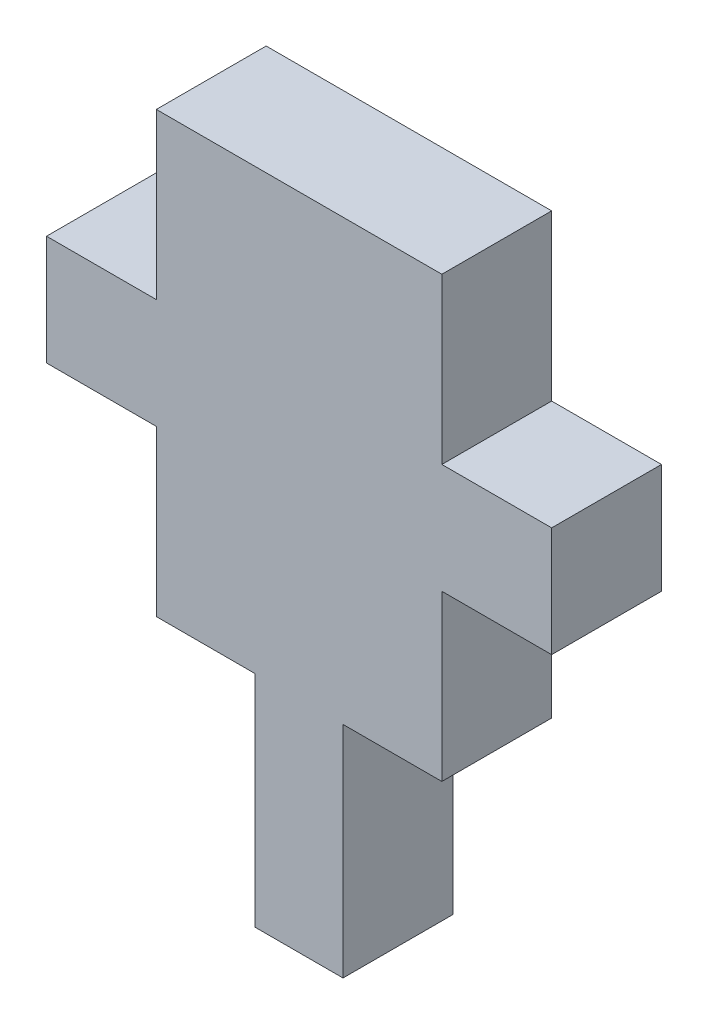
ISO-10303-21;
HEADER;
FILE_DESCRIPTION(('STEP AP214'),'2;1');
FILE_NAME('part.step','',(''),(''),'','','');
FILE_SCHEMA(('AUTOMOTIVE_DESIGN { 1 0 10303 214 1 1 1 1 }'));
ENDSEC;
DATA;
#1=APPLICATION_CONTEXT('core data for automotive mechanical design processes');
#2=APPLICATION_PROTOCOL_DEFINITION('international standard','automotive_design',2000,#1);
#3=PRODUCT_CONTEXT('',#1,'mechanical');
#4=PRODUCT('Part','Part','',(#3));
#5=PRODUCT_RELATED_PRODUCT_CATEGORY('part','',(#4));
#6=PRODUCT_DEFINITION_FORMATION('','',#4);
#7=PRODUCT_DEFINITION_CONTEXT('part definition',#1,'design');
#8=PRODUCT_DEFINITION('design','',#6,#7);
#9=PRODUCT_DEFINITION_SHAPE('','',#8);
#10=(LENGTH_UNIT() NAMED_UNIT(*) SI_UNIT(.MILLI.,.METRE.));
#11=(NAMED_UNIT(*) PLANE_ANGLE_UNIT() SI_UNIT($,.RADIAN.));
#12=(NAMED_UNIT(*) SI_UNIT($,.STERADIAN.) SOLID_ANGLE_UNIT());
#13=UNCERTAINTY_MEASURE_WITH_UNIT(LENGTH_MEASURE(1.E-05),#10,'distance_accuracy_value','');
#14=(GEOMETRIC_REPRESENTATION_CONTEXT(3) GLOBAL_UNCERTAINTY_ASSIGNED_CONTEXT((#13)) GLOBAL_UNIT_ASSIGNED_CONTEXT((#10,
#11,#12)) REPRESENTATION_CONTEXT('',''));
#15=CARTESIAN_POINT('',(0.,0.,0.));
#16=DIRECTION('',(0.,0.,1.));
#17=DIRECTION('',(1.,0.,0.));
#18=AXIS2_PLACEMENT_3D('',#15,#16,#17);
#19=CARTESIAN_POINT('',(8.5,0.,5.));
#20=DIRECTION('',(1.,0.,0.));
#21=DIRECTION('',(0.,0.,-1.));
#22=AXIS2_PLACEMENT_3D('',#19,#20,#21);
#23=PLANE('',#22);
#24=DIRECTION('',(0.,-1.,0.));
#25=VECTOR('',#24,1.);
#26=CARTESIAN_POINT('',(8.5,0.,0.));
#27=LINE('',#26,#25);
#28=CARTESIAN_POINT('',(8.5,0.,0.));
#29=VERTEX_POINT('',#28);
#30=CARTESIAN_POINT('',(8.5,-10.,0.));
#31=VERTEX_POINT('',#30);
#32=EDGE_CURVE('E179',#29,#31,#27,.T.);
#33=ORIENTED_EDGE('',*,*,#32,.F.);
#34=DIRECTION('',(0.,0.,-1.));
#35=VECTOR('',#34,1.);
#36=CARTESIAN_POINT('',(8.5,0.,5.));
#37=LINE('',#36,#35);
#38=CARTESIAN_POINT('',(8.5,0.,5.));
#39=VERTEX_POINT('',#38);
#40=EDGE_CURVE('E11',#39,#29,#37,.T.);
#41=ORIENTED_EDGE('',*,*,#40,.F.);
#42=DIRECTION('',(0.,-1.,0.));
#43=VECTOR('',#42,1.);
#44=CARTESIAN_POINT('',(8.5,0.,5.));
#45=LINE('',#44,#43);
#46=CARTESIAN_POINT('',(8.5,-10.,5.));
#47=VERTEX_POINT('',#46);
#48=EDGE_CURVE('E213',#39,#47,#45,.T.);
#49=ORIENTED_EDGE('',*,*,#48,.T.);
#50=DIRECTION('',(0.,0.,-1.));
#51=VECTOR('',#50,1.);
#52=CARTESIAN_POINT('',(8.5,-10.,5.));
#53=LINE('',#52,#51);
#54=EDGE_CURVE('E110',#47,#31,#53,.T.);
#55=ORIENTED_EDGE('',*,*,#54,.T.);
#56=EDGE_LOOP('',(#33,#41,#49,#55));
#57=FACE_BOUND('',#56,.T.);
#58=ADVANCED_FACE('F35',(#57),#23,.T.);
#59=CARTESIAN_POINT('',(0.,0.,5.));
#60=DIRECTION('',(0.,1.,0.));
#61=DIRECTION('',(0.,0.,1.));
#62=AXIS2_PLACEMENT_3D('',#59,#60,#61);
#63=PLANE('',#62);
#64=DIRECTION('',(1.,0.,0.));
#65=VECTOR('',#64,1.);
#66=CARTESIAN_POINT('',(0.,0.,0.));
#67=LINE('',#66,#65);
#68=CARTESIAN_POINT('',(13.,0.,0.));
#69=VERTEX_POINT('',#68);
#70=EDGE_CURVE('E182',#29,#69,#67,.T.);
#71=ORIENTED_EDGE('',*,*,#70,.T.);
#72=DIRECTION('',(0.,0.,-1.));
#73=VECTOR('',#72,1.);
#74=CARTESIAN_POINT('',(13.,0.,5.));
#75=LINE('',#74,#73);
#76=CARTESIAN_POINT('',(13.,0.,5.));
#77=VERTEX_POINT('',#76);
#78=EDGE_CURVE('E43',#77,#69,#75,.T.);
#79=ORIENTED_EDGE('',*,*,#78,.F.);
#80=DIRECTION('',(1.,0.,0.));
#81=VECTOR('',#80,1.);
#82=CARTESIAN_POINT('',(0.,0.,5.));
#83=LINE('',#82,#81);
#84=EDGE_CURVE('E164',#39,#77,#83,.T.);
#85=ORIENTED_EDGE('',*,*,#84,.F.);
#86=ORIENTED_EDGE('',*,*,#40,.T.);
#87=EDGE_LOOP('',(#71,#79,#85,#86));
#88=FACE_BOUND('',#87,.T.);
#89=ADVANCED_FACE('F328',(#88),#63,.F.);
#90=CARTESIAN_POINT('',(13.,0.,5.));
#91=DIRECTION('',(-1.,0.,0.));
#92=DIRECTION('',(0.,0.,1.));
#93=AXIS2_PLACEMENT_3D('',#90,#91,#92);
#94=PLANE('',#93);
#95=DIRECTION('',(0.,1.,0.));
#96=VECTOR('',#95,1.);
#97=CARTESIAN_POINT('',(13.,0.,0.));
#98=LINE('',#97,#96);
#99=CARTESIAN_POINT('',(13.,7.5,0.));
#100=VERTEX_POINT('',#99);
#101=EDGE_CURVE('E184',#69,#100,#98,.T.);
#102=ORIENTED_EDGE('',*,*,#101,.T.);
#103=DIRECTION('',(0.,0.,-1.));
#104=VECTOR('',#103,1.);
#105=CARTESIAN_POINT('',(13.,7.5,5.));
#106=LINE('',#105,#104);
#107=CARTESIAN_POINT('',(13.,7.5,5.));
#108=VERTEX_POINT('',#107);
#109=EDGE_CURVE('E237',#108,#100,#106,.T.);
#110=ORIENTED_EDGE('',*,*,#109,.F.);
#111=DIRECTION('',(0.,1.,0.));
#112=VECTOR('',#111,1.);
#113=CARTESIAN_POINT('',(13.,0.,5.));
#114=LINE('',#113,#112);
#115=EDGE_CURVE('E246',#77,#108,#114,.T.);
#116=ORIENTED_EDGE('',*,*,#115,.F.);
#117=ORIENTED_EDGE('',*,*,#78,.T.);
#118=EDGE_LOOP('',(#102,#110,#116,#117));
#119=FACE_BOUND('',#118,.T.);
#120=ADVANCED_FACE('F244',(#119),#94,.F.);
#121=CARTESIAN_POINT('',(0.,7.5,5.));
#122=DIRECTION('',(0.,1.,0.));
#123=DIRECTION('',(0.,0.,1.));
#124=AXIS2_PLACEMENT_3D('',#121,#122,#123);
#125=PLANE('',#124);
#126=DIRECTION('',(1.,0.,0.));
#127=VECTOR('',#126,1.);
#128=CARTESIAN_POINT('',(0.,7.5,0.));
#129=LINE('',#128,#127);
#130=CARTESIAN_POINT('',(18.,7.5,0.));
#131=VERTEX_POINT('',#130);
#132=EDGE_CURVE('E186',#100,#131,#129,.T.);
#133=ORIENTED_EDGE('',*,*,#132,.T.);
#134=DIRECTION('',(0.,0.,-1.));
#135=VECTOR('',#134,1.);
#136=CARTESIAN_POINT('',(18.,7.5,5.));
#137=LINE('',#136,#135);
#138=CARTESIAN_POINT('',(18.,7.5,5.));
#139=VERTEX_POINT('',#138);
#140=EDGE_CURVE('E234',#139,#131,#137,.T.);
#141=ORIENTED_EDGE('',*,*,#140,.F.);
#142=DIRECTION('',(1.,0.,0.));
#143=VECTOR('',#142,1.);
#144=CARTESIAN_POINT('',(0.,7.5,5.));
#145=LINE('',#144,#143);
#146=EDGE_CURVE('E265',#108,#139,#145,.T.);
#147=ORIENTED_EDGE('',*,*,#146,.F.);
#148=ORIENTED_EDGE('',*,*,#109,.T.);
#149=EDGE_LOOP('',(#133,#141,#147,#148));
#150=FACE_BOUND('',#149,.T.);
#151=ADVANCED_FACE('F255',(#150),#125,.F.);
#152=CARTESIAN_POINT('',(18.,0.,5.));
#153=DIRECTION('',(-1.,0.,0.));
#154=DIRECTION('',(0.,-1.,0.));
#155=AXIS2_PLACEMENT_3D('',#152,#153,#154);
#156=PLANE('',#155);
#157=DIRECTION('',(0.,1.,0.));
#158=VECTOR('',#157,1.);
#159=CARTESIAN_POINT('',(18.,0.,0.));
#160=LINE('',#159,#158);
#161=CARTESIAN_POINT('',(18.,12.5,0.));
#162=VERTEX_POINT('',#161);
#163=EDGE_CURVE('E189',#131,#162,#160,.T.);
#164=ORIENTED_EDGE('',*,*,#163,.T.);
#165=DIRECTION('',(0.,0.,-1.));
#166=VECTOR('',#165,1.);
#167=CARTESIAN_POINT('',(18.,12.5,5.));
#168=LINE('',#167,#166);
#169=CARTESIAN_POINT('',(18.,12.5,5.));
#170=VERTEX_POINT('',#169);
#171=EDGE_CURVE('E232',#170,#162,#168,.T.);
#172=ORIENTED_EDGE('',*,*,#171,.F.);
#173=DIRECTION('',(0.,1.,0.));
#174=VECTOR('',#173,1.);
#175=CARTESIAN_POINT('',(18.,0.,5.));
#176=LINE('',#175,#174);
#177=EDGE_CURVE('E261',#139,#170,#176,.T.);
#178=ORIENTED_EDGE('',*,*,#177,.F.);
#179=ORIENTED_EDGE('',*,*,#140,.T.);
#180=EDGE_LOOP('',(#164,#172,#178,#179));
#181=FACE_BOUND('',#180,.T.);
#182=ADVANCED_FACE('F259',(#181),#156,.F.);
#183=CARTESIAN_POINT('',(0.,12.5,5.));
#184=DIRECTION('',(0.,1.,0.));
#185=DIRECTION('',(0.,0.,1.));
#186=AXIS2_PLACEMENT_3D('',#183,#184,#185);
#187=PLANE('',#186);
#188=DIRECTION('',(1.,0.,0.));
#189=VECTOR('',#188,1.);
#190=CARTESIAN_POINT('',(0.,12.5,0.));
#191=LINE('',#190,#189);
#192=CARTESIAN_POINT('',(13.,12.5,0.));
#193=VERTEX_POINT('',#192);
#194=EDGE_CURVE('E192',#193,#162,#191,.T.);
#195=ORIENTED_EDGE('',*,*,#194,.F.);
#196=DIRECTION('',(0.,0.,-1.));
#197=VECTOR('',#196,1.);
#198=CARTESIAN_POINT('',(13.,12.5,5.));
#199=LINE('',#198,#197);
#200=CARTESIAN_POINT('',(13.,12.5,5.));
#201=VERTEX_POINT('',#200);
#202=EDGE_CURVE('E230',#201,#193,#199,.T.);
#203=ORIENTED_EDGE('',*,*,#202,.F.);
#204=DIRECTION('',(1.,0.,0.));
#205=VECTOR('',#204,1.);
#206=CARTESIAN_POINT('',(0.,12.5,5.));
#207=LINE('',#206,#205);
#208=EDGE_CURVE('E264',#201,#170,#207,.T.);
#209=ORIENTED_EDGE('',*,*,#208,.T.);
#210=ORIENTED_EDGE('',*,*,#171,.T.);
#211=EDGE_LOOP('',(#195,#203,#209,#210));
#212=FACE_BOUND('',#211,.T.);
#213=ADVANCED_FACE('F318',(#212),#187,.T.);
#214=CARTESIAN_POINT('',(13.,20.,0.));
#215=VERTEX_POINT('',#214);
#216=EDGE_CURVE('E187',#193,#215,#98,.T.);
#217=ORIENTED_EDGE('',*,*,#216,.T.);
#218=DIRECTION('',(0.,0.,-1.));
#219=VECTOR('',#218,1.);
#220=CARTESIAN_POINT('',(13.,20.,5.));
#221=LINE('',#220,#219);
#222=CARTESIAN_POINT('',(13.,20.,5.));
#223=VERTEX_POINT('',#222);
#224=EDGE_CURVE('E228',#223,#215,#221,.T.);
#225=ORIENTED_EDGE('',*,*,#224,.F.);
#226=EDGE_CURVE('E267',#201,#223,#114,.T.);
#227=ORIENTED_EDGE('',*,*,#226,.F.);
#228=ORIENTED_EDGE('',*,*,#202,.T.);
#229=EDGE_LOOP('',(#217,#225,#227,#228));
#230=FACE_BOUND('',#229,.T.);
#231=ADVANCED_FACE('F299',(#230),#94,.F.);
#232=CARTESIAN_POINT('',(0.,20.,5.));
#233=DIRECTION('',(0.,1.,0.));
#234=DIRECTION('',(0.,0.,1.));
#235=AXIS2_PLACEMENT_3D('',#232,#233,#234);
#236=PLANE('',#235);
#237=DIRECTION('',(1.,0.,0.));
#238=VECTOR('',#237,1.);
#239=CARTESIAN_POINT('',(0.,20.,0.));
#240=LINE('',#239,#238);
#241=CARTESIAN_POINT('',(0.,20.,0.));
#242=VERTEX_POINT('',#241);
#243=EDGE_CURVE('E195',#242,#215,#240,.T.);
#244=ORIENTED_EDGE('',*,*,#243,.F.);
#245=DIRECTION('',(0.,0.,-1.));
#246=VECTOR('',#245,1.);
#247=CARTESIAN_POINT('',(0.,20.,5.));
#248=LINE('',#247,#246);
#249=CARTESIAN_POINT('',(0.,20.,5.));
#250=VERTEX_POINT('',#249);
#251=EDGE_CURVE('E226',#250,#242,#248,.T.);
#252=ORIENTED_EDGE('',*,*,#251,.F.);
#253=DIRECTION('',(1.,0.,0.));
#254=VECTOR('',#253,1.);
#255=CARTESIAN_POINT('',(0.,20.,5.));
#256=LINE('',#255,#254);
#257=EDGE_CURVE('E272',#250,#223,#256,.T.);
#258=ORIENTED_EDGE('',*,*,#257,.T.);
#259=ORIENTED_EDGE('',*,*,#224,.T.);
#260=EDGE_LOOP('',(#244,#252,#258,#259));
#261=FACE_BOUND('',#260,.T.);
#262=ADVANCED_FACE('F303',(#261),#236,.T.);
#263=CARTESIAN_POINT('',(0.,0.,5.));
#264=DIRECTION('',(-1.,0.,0.));
#265=DIRECTION('',(0.,0.,1.));
#266=AXIS2_PLACEMENT_3D('',#263,#264,#265);
#267=PLANE('',#266);
#268=DIRECTION('',(0.,1.,0.));
#269=VECTOR('',#268,1.);
#270=CARTESIAN_POINT('',(0.,0.,0.));
#271=LINE('',#270,#269);
#272=CARTESIAN_POINT('',(0.,12.5,0.));
#273=VERTEX_POINT('',#272);
#274=EDGE_CURVE('E198',#273,#242,#271,.T.);
#275=ORIENTED_EDGE('',*,*,#274,.F.);
#276=DIRECTION('',(0.,0.,-1.));
#277=VECTOR('',#276,1.);
#278=CARTESIAN_POINT('',(0.,12.5,5.));
#279=LINE('',#278,#277);
#280=CARTESIAN_POINT('',(0.,12.5,5.));
#281=VERTEX_POINT('',#280);
#282=EDGE_CURVE('E224',#281,#273,#279,.T.);
#283=ORIENTED_EDGE('',*,*,#282,.F.);
#284=DIRECTION('',(0.,1.,0.));
#285=VECTOR('',#284,1.);
#286=CARTESIAN_POINT('',(0.,0.,5.));
#287=LINE('',#286,#285);
#288=EDGE_CURVE('E275',#281,#250,#287,.T.);
#289=ORIENTED_EDGE('',*,*,#288,.T.);
#290=ORIENTED_EDGE('',*,*,#251,.T.);
#291=EDGE_LOOP('',(#275,#283,#289,#290));
#292=FACE_BOUND('',#291,.T.);
#293=ADVANCED_FACE('F306',(#292),#267,.T.);
#294=CARTESIAN_POINT('',(0.,12.5,5.));
#295=DIRECTION('',(0.,-1.,0.));
#296=DIRECTION('',(0.,0.,-1.));
#297=AXIS2_PLACEMENT_3D('',#294,#295,#296);
#298=PLANE('',#297);
#299=DIRECTION('',(-1.,0.,0.));
#300=VECTOR('',#299,1.);
#301=CARTESIAN_POINT('',(0.,12.5,0.));
#302=LINE('',#301,#300);
#303=CARTESIAN_POINT('',(-5.,12.5,0.));
#304=VERTEX_POINT('',#303);
#305=EDGE_CURVE('E201',#273,#304,#302,.T.);
#306=ORIENTED_EDGE('',*,*,#305,.T.);
#307=DIRECTION('',(0.,0.,-1.));
#308=VECTOR('',#307,1.);
#309=CARTESIAN_POINT('',(-5.,12.5,5.));
#310=LINE('',#309,#308);
#311=CARTESIAN_POINT('',(-5.,12.5,5.));
#312=VERTEX_POINT('',#311);
#313=EDGE_CURVE('E221',#312,#304,#310,.T.);
#314=ORIENTED_EDGE('',*,*,#313,.F.);
#315=DIRECTION('',(-1.,0.,0.));
#316=VECTOR('',#315,1.);
#317=CARTESIAN_POINT('',(0.,12.5,5.));
#318=LINE('',#317,#316);
#319=EDGE_CURVE('E278',#281,#312,#318,.T.);
#320=ORIENTED_EDGE('',*,*,#319,.F.);
#321=ORIENTED_EDGE('',*,*,#282,.T.);
#322=EDGE_LOOP('',(#306,#314,#320,#321));
#323=FACE_BOUND('',#322,.T.);
#324=ADVANCED_FACE('F310',(#323),#298,.F.);
#325=CARTESIAN_POINT('',(-5.,0.,5.));
#326=DIRECTION('',(1.,0.,0.));
#327=DIRECTION('',(0.,1.,0.));
#328=AXIS2_PLACEMENT_3D('',#325,#326,#327);
#329=PLANE('',#328);
#330=DIRECTION('',(0.,-1.,0.));
#331=VECTOR('',#330,1.);
#332=CARTESIAN_POINT('',(-5.,0.,0.));
#333=LINE('',#332,#331);
#334=CARTESIAN_POINT('',(-5.,7.5,0.));
#335=VERTEX_POINT('',#334);
#336=EDGE_CURVE('E204',#304,#335,#333,.T.);
#337=ORIENTED_EDGE('',*,*,#336,.T.);
#338=DIRECTION('',(0.,0.,-1.));
#339=VECTOR('',#338,1.);
#340=CARTESIAN_POINT('',(-5.,7.5,5.));
#341=LINE('',#340,#339);
#342=CARTESIAN_POINT('',(-5.,7.5,5.));
#343=VERTEX_POINT('',#342);
#344=EDGE_CURVE('E219',#343,#335,#341,.T.);
#345=ORIENTED_EDGE('',*,*,#344,.F.);
#346=DIRECTION('',(0.,-1.,0.));
#347=VECTOR('',#346,1.);
#348=CARTESIAN_POINT('',(-5.,0.,5.));
#349=LINE('',#348,#347);
#350=EDGE_CURVE('E279',#312,#343,#349,.T.);
#351=ORIENTED_EDGE('',*,*,#350,.F.);
#352=ORIENTED_EDGE('',*,*,#313,.T.);
#353=EDGE_LOOP('',(#337,#345,#351,#352));
#354=FACE_BOUND('',#353,.T.);
#355=ADVANCED_FACE('F314',(#354),#329,.F.);
#356=CARTESIAN_POINT('',(0.,7.5,5.));
#357=DIRECTION('',(0.,-1.,0.));
#358=DIRECTION('',(1.,0.,0.));
#359=AXIS2_PLACEMENT_3D('',#356,#357,#358);
#360=PLANE('',#359);
#361=DIRECTION('',(-1.,0.,0.));
#362=VECTOR('',#361,1.);
#363=CARTESIAN_POINT('',(0.,7.5,0.));
#364=LINE('',#363,#362);
#365=CARTESIAN_POINT('',(0.,7.5,0.));
#366=VERTEX_POINT('',#365);
#367=EDGE_CURVE('E207',#366,#335,#364,.T.);
#368=ORIENTED_EDGE('',*,*,#367,.F.);
#369=DIRECTION('',(0.,0.,-1.));
#370=VECTOR('',#369,1.);
#371=CARTESIAN_POINT('',(0.,7.5,5.));
#372=LINE('',#371,#370);
#373=CARTESIAN_POINT('',(0.,7.5,5.));
#374=VERTEX_POINT('',#373);
#375=EDGE_CURVE('E217',#374,#366,#372,.T.);
#376=ORIENTED_EDGE('',*,*,#375,.F.);
#377=DIRECTION('',(-1.,0.,0.));
#378=VECTOR('',#377,1.);
#379=CARTESIAN_POINT('',(0.,7.5,5.));
#380=LINE('',#379,#378);
#381=EDGE_CURVE('E176',#374,#343,#380,.T.);
#382=ORIENTED_EDGE('',*,*,#381,.T.);
#383=ORIENTED_EDGE('',*,*,#344,.T.);
#384=EDGE_LOOP('',(#368,#376,#382,#383));
#385=FACE_BOUND('',#384,.T.);
#386=ADVANCED_FACE('F315',(#385),#360,.T.);
#387=CARTESIAN_POINT('',(0.,0.,0.));
#388=VERTEX_POINT('',#387);
#389=EDGE_CURVE('E202',#388,#366,#271,.T.);
#390=ORIENTED_EDGE('',*,*,#389,.F.);
#391=DIRECTION('',(0.,0.,-1.));
#392=VECTOR('',#391,1.);
#393=CARTESIAN_POINT('',(0.,0.,5.));
#394=LINE('',#393,#392);
#395=CARTESIAN_POINT('',(0.,0.,5.));
#396=VERTEX_POINT('',#395);
#397=EDGE_CURVE('E169',#396,#388,#394,.T.);
#398=ORIENTED_EDGE('',*,*,#397,.F.);
#399=EDGE_CURVE('E161',#396,#374,#287,.T.);
#400=ORIENTED_EDGE('',*,*,#399,.T.);
#401=ORIENTED_EDGE('',*,*,#375,.T.);
#402=EDGE_LOOP('',(#390,#398,#400,#401));
#403=FACE_BOUND('',#402,.T.);
#404=ADVANCED_FACE('F286',(#403),#267,.T.);
#405=CARTESIAN_POINT('',(4.5,0.,0.));
#406=VERTEX_POINT('',#405);
#407=EDGE_CURVE('E168',#388,#406,#67,.T.);
#408=ORIENTED_EDGE('',*,*,#407,.T.);
#409=DIRECTION('',(0.,0.,-1.));
#410=VECTOR('',#409,1.);
#411=CARTESIAN_POINT('',(4.5,0.,5.));
#412=LINE('',#411,#410);
#413=CARTESIAN_POINT('',(4.5,0.,5.));
#414=VERTEX_POINT('',#413);
#415=EDGE_CURVE('E165',#414,#406,#412,.T.);
#416=ORIENTED_EDGE('',*,*,#415,.F.);
#417=EDGE_CURVE('E154',#396,#414,#83,.T.);
#418=ORIENTED_EDGE('',*,*,#417,.F.);
#419=ORIENTED_EDGE('',*,*,#397,.T.);
#420=EDGE_LOOP('',(#408,#416,#418,#419));
#421=FACE_BOUND('',#420,.T.);
#422=ADVANCED_FACE('F166',(#421),#63,.F.);
#423=CARTESIAN_POINT('',(4.5,0.,5.));
#424=DIRECTION('',(1.,0.,0.));
#425=DIRECTION('',(0.,0.,-1.));
#426=AXIS2_PLACEMENT_3D('',#423,#424,#425);
#427=PLANE('',#426);
#428=DIRECTION('',(0.,-1.,0.));
#429=VECTOR('',#428,1.);
#430=CARTESIAN_POINT('',(4.5,0.,0.));
#431=LINE('',#430,#429);
#432=CARTESIAN_POINT('',(4.5,-10.,0.));
#433=VERTEX_POINT('',#432);
#434=EDGE_CURVE('E103',#406,#433,#431,.T.);
#435=ORIENTED_EDGE('',*,*,#434,.T.);
#436=DIRECTION('',(0.,0.,-1.));
#437=VECTOR('',#436,1.);
#438=CARTESIAN_POINT('',(4.5,-10.,5.));
#439=LINE('',#438,#437);
#440=CARTESIAN_POINT('',(4.5,-10.,5.));
#441=VERTEX_POINT('',#440);
#442=EDGE_CURVE('E170',#441,#433,#439,.T.);
#443=ORIENTED_EDGE('',*,*,#442,.F.);
#444=DIRECTION('',(0.,-1.,0.));
#445=VECTOR('',#444,1.);
#446=CARTESIAN_POINT('',(4.5,0.,5.));
#447=LINE('',#446,#445);
#448=EDGE_CURVE('E158',#414,#441,#447,.T.);
#449=ORIENTED_EDGE('',*,*,#448,.F.);
#450=ORIENTED_EDGE('',*,*,#415,.T.);
#451=EDGE_LOOP('',(#435,#443,#449,#450));
#452=FACE_BOUND('',#451,.T.);
#453=ADVANCED_FACE('F172',(#452),#427,.F.);
#454=CARTESIAN_POINT('',(0.,-10.,5.));
#455=DIRECTION('',(0.,1.,0.));
#456=DIRECTION('',(0.,0.,1.));
#457=AXIS2_PLACEMENT_3D('',#454,#455,#456);
#458=PLANE('',#457);
#459=DIRECTION('',(1.,0.,0.));
#460=VECTOR('',#459,1.);
#461=CARTESIAN_POINT('',(0.,-10.,0.));
#462=LINE('',#461,#460);
#463=EDGE_CURVE('E211',#433,#31,#462,.T.);
#464=ORIENTED_EDGE('',*,*,#463,.T.);
#465=ORIENTED_EDGE('',*,*,#54,.F.);
#466=DIRECTION('',(1.,0.,0.));
#467=VECTOR('',#466,1.);
#468=CARTESIAN_POINT('',(0.,-10.,5.));
#469=LINE('',#468,#467);
#470=EDGE_CURVE('E51',#441,#47,#469,.T.);
#471=ORIENTED_EDGE('',*,*,#470,.F.);
#472=ORIENTED_EDGE('',*,*,#442,.T.);
#473=EDGE_LOOP('',(#464,#465,#471,#472));
#474=FACE_BOUND('',#473,.T.);
#475=ADVANCED_FACE('F291',(#474),#458,.F.);
#476=CARTESIAN_POINT('',(0.,0.,5.));
#477=DIRECTION('',(0.,0.,1.));
#478=DIRECTION('',(1.,0.,0.));
#479=AXIS2_PLACEMENT_3D('',#476,#477,#478);
#480=PLANE('',#479);
#481=ORIENTED_EDGE('',*,*,#48,.F.);
#482=ORIENTED_EDGE('',*,*,#84,.T.);
#483=ORIENTED_EDGE('',*,*,#115,.T.);
#484=ORIENTED_EDGE('',*,*,#146,.T.);
#485=ORIENTED_EDGE('',*,*,#177,.T.);
#486=ORIENTED_EDGE('',*,*,#208,.F.);
#487=ORIENTED_EDGE('',*,*,#226,.T.);
#488=ORIENTED_EDGE('',*,*,#257,.F.);
#489=ORIENTED_EDGE('',*,*,#288,.F.);
#490=ORIENTED_EDGE('',*,*,#319,.T.);
#491=ORIENTED_EDGE('',*,*,#350,.T.);
#492=ORIENTED_EDGE('',*,*,#381,.F.);
#493=ORIENTED_EDGE('',*,*,#399,.F.);
#494=ORIENTED_EDGE('',*,*,#417,.T.);
#495=ORIENTED_EDGE('',*,*,#448,.T.);
#496=ORIENTED_EDGE('',*,*,#470,.T.);
#497=EDGE_LOOP('',(#481,#482,#483,#484,#485,#486,#487,#488,#489,#490,#491,#492,#493,#494,#495,#496));
#498=FACE_BOUND('',#497,.T.);
#499=ADVANCED_FACE('F156',(#498),#480,.T.);
#500=CARTESIAN_POINT('',(0.,0.,0.));
#501=DIRECTION('',(0.,0.,1.));
#502=DIRECTION('',(1.,0.,0.));
#503=AXIS2_PLACEMENT_3D('',#500,#501,#502);
#504=PLANE('',#503);
#505=ORIENTED_EDGE('',*,*,#32,.T.);
#506=ORIENTED_EDGE('',*,*,#463,.F.);
#507=ORIENTED_EDGE('',*,*,#434,.F.);
#508=ORIENTED_EDGE('',*,*,#407,.F.);
#509=ORIENTED_EDGE('',*,*,#389,.T.);
#510=ORIENTED_EDGE('',*,*,#367,.T.);
#511=ORIENTED_EDGE('',*,*,#336,.F.);
#512=ORIENTED_EDGE('',*,*,#305,.F.);
#513=ORIENTED_EDGE('',*,*,#274,.T.);
#514=ORIENTED_EDGE('',*,*,#243,.T.);
#515=ORIENTED_EDGE('',*,*,#216,.F.);
#516=ORIENTED_EDGE('',*,*,#194,.T.);
#517=ORIENTED_EDGE('',*,*,#163,.F.);
#518=ORIENTED_EDGE('',*,*,#132,.F.);
#519=ORIENTED_EDGE('',*,*,#101,.F.);
#520=ORIENTED_EDGE('',*,*,#70,.F.);
#521=EDGE_LOOP('',(#505,#506,#507,#508,#509,#510,#511,#512,#513,#514,#515,#516,#517,#518,#519,#520));
#522=FACE_BOUND('',#521,.T.);
#523=ADVANCED_FACE('F251',(#522),#504,.F.);
#524=CLOSED_SHELL('',(#58,#89,#120,#151,#182,#213,#231,#262,#293,#324,#355,#386,#404,#422,#453,
#475,#499,#523));
#525=MANIFOLD_SOLID_BREP('B2',#524);
#526=ADVANCED_BREP_SHAPE_REPRESENTATION('',(#18,#525),#14);
#527=SHAPE_DEFINITION_REPRESENTATION(#9,#526);
ENDSEC;
END-ISO-10303-21;
